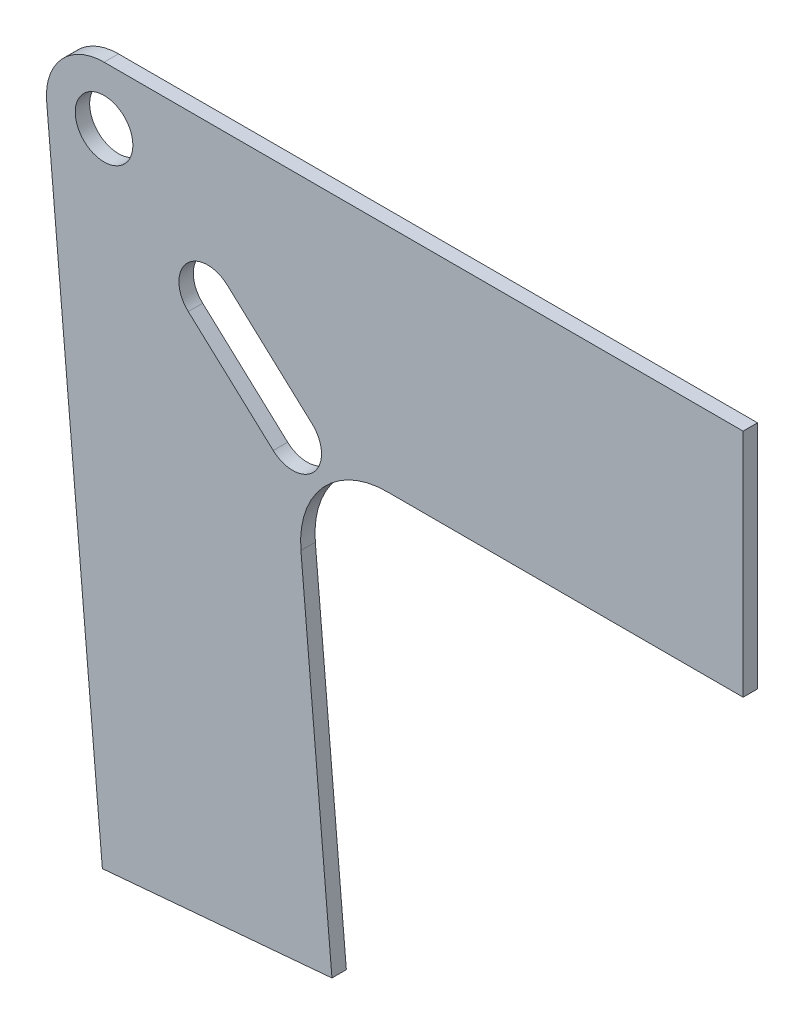
ISO-10303-21;
HEADER;
FILE_DESCRIPTION(('STEP AP214'),'2;1');
FILE_NAME('part.step','',(''),(''),'','','');
FILE_SCHEMA(('AUTOMOTIVE_DESIGN { 1 0 10303 214 1 1 1 1 }'));
ENDSEC;
DATA;
#1=APPLICATION_CONTEXT('core data for automotive mechanical design processes');
#2=APPLICATION_PROTOCOL_DEFINITION('international standard','automotive_design',2000,#1);
#3=PRODUCT_CONTEXT('',#1,'mechanical');
#4=PRODUCT('Part','Part','',(#3));
#5=PRODUCT_RELATED_PRODUCT_CATEGORY('part','',(#4));
#6=PRODUCT_DEFINITION_FORMATION('','',#4);
#7=PRODUCT_DEFINITION_CONTEXT('part definition',#1,'design');
#8=PRODUCT_DEFINITION('design','',#6,#7);
#9=PRODUCT_DEFINITION_SHAPE('','',#8);
#10=(LENGTH_UNIT() NAMED_UNIT(*) SI_UNIT(.MILLI.,.METRE.));
#11=(NAMED_UNIT(*) PLANE_ANGLE_UNIT() SI_UNIT($,.RADIAN.));
#12=(NAMED_UNIT(*) SI_UNIT($,.STERADIAN.) SOLID_ANGLE_UNIT());
#13=UNCERTAINTY_MEASURE_WITH_UNIT(LENGTH_MEASURE(1.E-05),#10,'distance_accuracy_value','');
#14=(GEOMETRIC_REPRESENTATION_CONTEXT(3) GLOBAL_UNCERTAINTY_ASSIGNED_CONTEXT((#13)) GLOBAL_UNIT_ASSIGNED_CONTEXT((#10,
#11,#12)) REPRESENTATION_CONTEXT('',''));
#15=CARTESIAN_POINT('',(0.,0.,0.));
#16=DIRECTION('',(0.,0.,1.));
#17=DIRECTION('',(1.,0.,0.));
#18=AXIS2_PLACEMENT_3D('',#15,#16,#17);
#19=CARTESIAN_POINT('',(-78.4913371274712,-44.45,3.175));
#20=DIRECTION('',(0.,0.,-1.));
#21=DIRECTION('',(-1.,0.,0.));
#22=AXIS2_PLACEMENT_3D('',#19,#20,#21);
#23=PLANE('',#22);
#24=DIRECTION('',(1.,0.,0.));
#25=VECTOR('',#24,1.);
#26=CARTESIAN_POINT('',(0.,-25.4,3.175));
#27=LINE('',#26,#25);
#28=CARTESIAN_POINT('',(-78.4913371274712,-25.4,3.175));
#29=VERTEX_POINT('',#28);
#30=CARTESIAN_POINT('',(0.,-25.4,3.175));
#31=VERTEX_POINT('',#30);
#32=EDGE_CURVE('E161',#29,#31,#27,.T.);
#33=ORIENTED_EDGE('',*,*,#32,.T.);
#34=DIRECTION('',(0.,1.,0.));
#35=VECTOR('',#34,1.);
#36=CARTESIAN_POINT('',(0.,25.4,3.175));
#37=LINE('',#36,#35);
#38=CARTESIAN_POINT('',(0.,25.4,3.175));
#39=VERTEX_POINT('',#38);
#40=EDGE_CURVE('E164',#31,#39,#37,.T.);
#41=ORIENTED_EDGE('',*,*,#40,.T.);
#42=DIRECTION('',(-1.,0.,0.));
#43=VECTOR('',#42,1.);
#44=CARTESIAN_POINT('',(-140.85961796358,25.4,3.175));
#45=LINE('',#44,#43);
#46=CARTESIAN_POINT('',(-140.85961796358,25.4,3.175));
#47=VERTEX_POINT('',#46);
#48=EDGE_CURVE('E167',#39,#47,#45,.T.);
#49=ORIENTED_EDGE('',*,*,#48,.T.);
#50=CARTESIAN_POINT('',(-140.85961796358,12.7,3.175));
#51=DIRECTION('',(0.,0.,1.));
#52=DIRECTION('',(-1.,0.,0.));
#53=AXIS2_PLACEMENT_3D('',#50,#51,#52);
#54=CIRCLE('',#53,12.7);
#55=CARTESIAN_POINT('',(-153.511290629345,11.5931220671048,3.175));
#56=VERTEX_POINT('',#55);
#57=EDGE_CURVE('E169',#47,#56,#54,.T.);
#58=ORIENTED_EDGE('',*,*,#57,.T.);
#59=DIRECTION('',(0.0871557427476542,-0.996194698091746,0.));
#60=VECTOR('',#59,1.);
#61=CARTESIAN_POINT('',(-141.234566002578,-128.730482523442,3.175));
#62=LINE('',#61,#60);
#63=CARTESIAN_POINT('',(-141.234566002578,-128.730482523442,3.175));
#64=VERTEX_POINT('',#63);
#65=EDGE_CURVE('E171',#56,#64,#62,.T.);
#66=ORIENTED_EDGE('',*,*,#65,.T.);
#67=DIRECTION('',(0.996194698091746,0.0871557427476551,0.));
#68=VECTOR('',#67,1.);
#69=CARTESIAN_POINT('',(-141.234566002578,-128.730482523442,3.175));
#70=LINE('',#69,#68);
#71=CARTESIAN_POINT('',(-90.6278753395175,-124.302970791861,3.175));
#72=VERTEX_POINT('',#71);
#73=EDGE_CURVE('E173',#64,#72,#70,.T.);
#74=ORIENTED_EDGE('',*,*,#73,.T.);
#75=DIRECTION('',(-0.0871557427476564,0.996194698091746,0.));
#76=VECTOR('',#75,1.);
#77=CARTESIAN_POINT('',(-90.6278753395175,-124.302970791861,3.175));
#78=LINE('',#77,#76);
#79=CARTESIAN_POINT('',(-97.4688461261189,-46.1103168993429,3.175));
#80=VERTEX_POINT('',#79);
#81=EDGE_CURVE('E175',#72,#80,#78,.T.);
#82=ORIENTED_EDGE('',*,*,#81,.T.);
#83=CARTESIAN_POINT('',(-78.4913371274712,-44.45,3.175));
#84=DIRECTION('',(0.,0.,-1.));
#85=DIRECTION('',(-1.,0.,0.));
#86=AXIS2_PLACEMENT_3D('',#83,#84,#85);
#87=CIRCLE('',#86,19.05);
#88=EDGE_CURVE('E177',#80,#29,#87,.T.);
#89=ORIENTED_EDGE('',*,*,#88,.T.);
#90=EDGE_LOOP('',(#33,#41,#49,#58,#66,#74,#82,#89));
#91=FACE_BOUND('',#90,.T.);
#92=CARTESIAN_POINT('',(-99.2807640728408,-25.4,3.175));
#93=DIRECTION('',(0.,0.,1.));
#94=DIRECTION('',(1.,0.,0.));
#95=AXIS2_PLACEMENT_3D('',#92,#93,#94);
#96=CIRCLE('',#95,6.35000000000001);
#97=CARTESIAN_POINT('',(-103.5707618912,-30.0817110887443,3.175));
#98=VERTEX_POINT('',#97);
#99=CARTESIAN_POINT('',(-94.9907662544813,-20.7182889112557,3.175));
#100=VERTEX_POINT('',#99);
#101=EDGE_CURVE('E122',#98,#100,#96,.T.);
#102=ORIENTED_EDGE('',*,*,#101,.F.);
#103=DIRECTION('',(0.737277336810121,-0.675590207615664,0.));
#104=VECTOR('',#103,1.);
#105=CARTESIAN_POINT('',(-103.5707618912,-30.0817110887443,3.175));
#106=LINE('',#105,#104);
#107=CARTESIAN_POINT('',(-122.297606246177,-12.9217198153064,3.175));
#108=VERTEX_POINT('',#107);
#109=EDGE_CURVE('E145',#108,#98,#106,.T.);
#110=ORIENTED_EDGE('',*,*,#109,.F.);
#111=CARTESIAN_POINT('',(-118.007608427818,-8.24000872656215,3.175));
#112=DIRECTION('',(0.,0.,1.));
#113=DIRECTION('',(1.,0.,0.));
#114=AXIS2_PLACEMENT_3D('',#111,#112,#113);
#115=CIRCLE('',#114,6.35);
#116=CARTESIAN_POINT('',(-113.717610609458,-3.55829763781789,3.175));
#117=VERTEX_POINT('',#116);
#118=EDGE_CURVE('E143',#117,#108,#115,.T.);
#119=ORIENTED_EDGE('',*,*,#118,.F.);
#120=DIRECTION('',(-0.737277336810121,0.675590207615663,0.));
#121=VECTOR('',#120,1.);
#122=CARTESIAN_POINT('',(-94.9907662544813,-20.7182889112557,3.175));
#123=LINE('',#122,#121);
#124=EDGE_CURVE('E130',#100,#117,#123,.T.);
#125=ORIENTED_EDGE('',*,*,#124,.F.);
#126=EDGE_LOOP('',(#102,#110,#119,#125));
#127=FACE_BOUND('',#126,.T.);
#128=CARTESIAN_POINT('',(-140.85961796358,12.7,3.175));
#129=DIRECTION('',(0.,0.,1.));
#130=DIRECTION('',(1.,0.,0.));
#131=AXIS2_PLACEMENT_3D('',#128,#129,#130);
#132=CIRCLE('',#131,6.35);
#133=CARTESIAN_POINT('',(-134.50961796358,12.7,3.175));
#134=VERTEX_POINT('',#133);
#135=EDGE_CURVE('E151',#134,#134,#132,.T.);
#136=ORIENTED_EDGE('',*,*,#135,.F.);
#137=EDGE_LOOP('',(#136));
#138=FACE_BOUND('',#137,.T.);
#139=ADVANCED_FACE('F33',(#91,#127,#138),#23,.F.);
#140=CARTESIAN_POINT('',(-78.4913371274712,-44.45,0.));
#141=DIRECTION('',(0.,0.,-1.));
#142=DIRECTION('',(-1.,0.,0.));
#143=AXIS2_PLACEMENT_3D('',#140,#141,#142);
#144=PLANE('',#143);
#145=DIRECTION('',(0.737277336810121,-0.675590207615664,0.));
#146=VECTOR('',#145,1.);
#147=CARTESIAN_POINT('',(-103.5707618912,-30.0817110887443,0.));
#148=LINE('',#147,#146);
#149=CARTESIAN_POINT('',(-122.297606246177,-12.9217198153064,0.));
#150=VERTEX_POINT('',#149);
#151=CARTESIAN_POINT('',(-103.5707618912,-30.0817110887443,0.));
#152=VERTEX_POINT('',#151);
#153=EDGE_CURVE('E131',#150,#152,#148,.T.);
#154=ORIENTED_EDGE('',*,*,#153,.T.);
#155=CARTESIAN_POINT('',(-99.2807640728408,-25.4,0.));
#156=DIRECTION('',(0.,0.,1.));
#157=DIRECTION('',(1.,0.,0.));
#158=AXIS2_PLACEMENT_3D('',#155,#156,#157);
#159=CIRCLE('',#158,6.35000000000001);
#160=CARTESIAN_POINT('',(-94.9907662544813,-20.7182889112557,0.));
#161=VERTEX_POINT('',#160);
#162=EDGE_CURVE('E56',#152,#161,#159,.T.);
#163=ORIENTED_EDGE('',*,*,#162,.T.);
#164=DIRECTION('',(-0.737277336810121,0.675590207615663,0.));
#165=VECTOR('',#164,1.);
#166=CARTESIAN_POINT('',(-94.9907662544813,-20.7182889112557,0.));
#167=LINE('',#166,#165);
#168=CARTESIAN_POINT('',(-113.717610609458,-3.55829763781789,0.));
#169=VERTEX_POINT('',#168);
#170=EDGE_CURVE('E137',#161,#169,#167,.T.);
#171=ORIENTED_EDGE('',*,*,#170,.T.);
#172=CARTESIAN_POINT('',(-118.007608427818,-8.24000872656215,0.));
#173=DIRECTION('',(0.,0.,1.));
#174=DIRECTION('',(1.,0.,0.));
#175=AXIS2_PLACEMENT_3D('',#172,#173,#174);
#176=CIRCLE('',#175,6.35);
#177=EDGE_CURVE('E153',#169,#150,#176,.T.);
#178=ORIENTED_EDGE('',*,*,#177,.T.);
#179=EDGE_LOOP('',(#154,#163,#171,#178));
#180=FACE_BOUND('',#179,.T.);
#181=DIRECTION('',(1.,0.,0.));
#182=VECTOR('',#181,1.);
#183=CARTESIAN_POINT('',(0.,-25.4,0.));
#184=LINE('',#183,#182);
#185=CARTESIAN_POINT('',(-78.4913371274712,-25.4,0.));
#186=VERTEX_POINT('',#185);
#187=CARTESIAN_POINT('',(0.,-25.4,0.));
#188=VERTEX_POINT('',#187);
#189=EDGE_CURVE('E138',#186,#188,#184,.T.);
#190=ORIENTED_EDGE('',*,*,#189,.F.);
#191=CARTESIAN_POINT('',(-78.4913371274712,-44.45,0.));
#192=DIRECTION('',(0.,0.,-1.));
#193=DIRECTION('',(-1.,0.,0.));
#194=AXIS2_PLACEMENT_3D('',#191,#192,#193);
#195=CIRCLE('',#194,19.05);
#196=CARTESIAN_POINT('',(-97.4688461261189,-46.1103168993429,0.));
#197=VERTEX_POINT('',#196);
#198=EDGE_CURVE('E165',#197,#186,#195,.T.);
#199=ORIENTED_EDGE('',*,*,#198,.F.);
#200=DIRECTION('',(-0.0871557427476564,0.996194698091746,0.));
#201=VECTOR('',#200,1.);
#202=CARTESIAN_POINT('',(-90.6278753395175,-124.302970791861,0.));
#203=LINE('',#202,#201);
#204=CARTESIAN_POINT('',(-90.6278753395175,-124.302970791861,0.));
#205=VERTEX_POINT('',#204);
#206=EDGE_CURVE('E192',#205,#197,#203,.T.);
#207=ORIENTED_EDGE('',*,*,#206,.F.);
#208=DIRECTION('',(0.996194698091746,0.0871557427476551,0.));
#209=VECTOR('',#208,1.);
#210=CARTESIAN_POINT('',(-141.234566002578,-128.730482523442,0.));
#211=LINE('',#210,#209);
#212=CARTESIAN_POINT('',(-141.234566002578,-128.730482523442,0.));
#213=VERTEX_POINT('',#212);
#214=EDGE_CURVE('E190',#213,#205,#211,.T.);
#215=ORIENTED_EDGE('',*,*,#214,.F.);
#216=DIRECTION('',(0.0871557427476542,-0.996194698091746,0.));
#217=VECTOR('',#216,1.);
#218=CARTESIAN_POINT('',(-141.234566002578,-128.730482523442,0.));
#219=LINE('',#218,#217);
#220=CARTESIAN_POINT('',(-153.511290629345,11.5931220671048,0.));
#221=VERTEX_POINT('',#220);
#222=EDGE_CURVE('E188',#221,#213,#219,.T.);
#223=ORIENTED_EDGE('',*,*,#222,.F.);
#224=CARTESIAN_POINT('',(-140.85961796358,12.7,0.));
#225=DIRECTION('',(0.,0.,1.));
#226=DIRECTION('',(-1.,0.,0.));
#227=AXIS2_PLACEMENT_3D('',#224,#225,#226);
#228=CIRCLE('',#227,12.7);
#229=CARTESIAN_POINT('',(-140.85961796358,25.4,0.));
#230=VERTEX_POINT('',#229);
#231=EDGE_CURVE('E186',#230,#221,#228,.T.);
#232=ORIENTED_EDGE('',*,*,#231,.F.);
#233=DIRECTION('',(-1.,0.,0.));
#234=VECTOR('',#233,1.);
#235=CARTESIAN_POINT('',(-140.85961796358,25.4,0.));
#236=LINE('',#235,#234);
#237=CARTESIAN_POINT('',(0.,25.4,0.));
#238=VERTEX_POINT('',#237);
#239=EDGE_CURVE('E184',#238,#230,#236,.T.);
#240=ORIENTED_EDGE('',*,*,#239,.F.);
#241=DIRECTION('',(0.,1.,0.));
#242=VECTOR('',#241,1.);
#243=CARTESIAN_POINT('',(0.,25.4,0.));
#244=LINE('',#243,#242);
#245=EDGE_CURVE('E182',#188,#238,#244,.T.);
#246=ORIENTED_EDGE('',*,*,#245,.F.);
#247=EDGE_LOOP('',(#190,#199,#207,#215,#223,#232,#240,#246));
#248=FACE_BOUND('',#247,.T.);
#249=CARTESIAN_POINT('',(-140.85961796358,12.7,0.));
#250=DIRECTION('',(0.,0.,1.));
#251=DIRECTION('',(1.,0.,0.));
#252=AXIS2_PLACEMENT_3D('',#249,#250,#251);
#253=CIRCLE('',#252,6.35);
#254=CARTESIAN_POINT('',(-134.50961796358,12.7,0.));
#255=VERTEX_POINT('',#254);
#256=EDGE_CURVE('E298',#255,#255,#253,.T.);
#257=ORIENTED_EDGE('',*,*,#256,.T.);
#258=EDGE_LOOP('',(#257));
#259=FACE_BOUND('',#258,.T.);
#260=ADVANCED_FACE('F222',(#180,#248,#259),#144,.T.);
#261=CARTESIAN_POINT('',(0.,-25.4,3.175));
#262=DIRECTION('',(0.,1.,0.));
#263=DIRECTION('',(0.,0.,1.));
#264=AXIS2_PLACEMENT_3D('',#261,#262,#263);
#265=PLANE('',#264);
#266=ORIENTED_EDGE('',*,*,#189,.T.);
#267=DIRECTION('',(0.,0.,-1.));
#268=VECTOR('',#267,1.);
#269=CARTESIAN_POINT('',(0.,-25.4,3.175));
#270=LINE('',#269,#268);
#271=EDGE_CURVE('E11',#31,#188,#270,.T.);
#272=ORIENTED_EDGE('',*,*,#271,.F.);
#273=ORIENTED_EDGE('',*,*,#32,.F.);
#274=DIRECTION('',(0.,0.,-1.));
#275=VECTOR('',#274,1.);
#276=CARTESIAN_POINT('',(-78.4913371274712,-25.4,3.175));
#277=LINE('',#276,#275);
#278=EDGE_CURVE('E179',#29,#186,#277,.T.);
#279=ORIENTED_EDGE('',*,*,#278,.T.);
#280=EDGE_LOOP('',(#266,#272,#273,#279));
#281=FACE_BOUND('',#280,.T.);
#282=ADVANCED_FACE('F35',(#281),#265,.F.);
#283=CARTESIAN_POINT('',(0.,25.4,3.175));
#284=DIRECTION('',(-1.,0.,0.));
#285=DIRECTION('',(0.,-1.,0.));
#286=AXIS2_PLACEMENT_3D('',#283,#284,#285);
#287=PLANE('',#286);
#288=ORIENTED_EDGE('',*,*,#245,.T.);
#289=DIRECTION('',(0.,0.,-1.));
#290=VECTOR('',#289,1.);
#291=CARTESIAN_POINT('',(0.,25.4,3.175));
#292=LINE('',#291,#290);
#293=EDGE_CURVE('E41',#39,#238,#292,.T.);
#294=ORIENTED_EDGE('',*,*,#293,.F.);
#295=ORIENTED_EDGE('',*,*,#40,.F.);
#296=ORIENTED_EDGE('',*,*,#271,.T.);
#297=EDGE_LOOP('',(#288,#294,#295,#296));
#298=FACE_BOUND('',#297,.T.);
#299=ADVANCED_FACE('F239',(#298),#287,.F.);
#300=CARTESIAN_POINT('',(-140.85961796358,25.4,3.175));
#301=DIRECTION('',(0.,-1.,0.));
#302=DIRECTION('',(1.,0.,0.));
#303=AXIS2_PLACEMENT_3D('',#300,#301,#302);
#304=PLANE('',#303);
#305=ORIENTED_EDGE('',*,*,#239,.T.);
#306=DIRECTION('',(0.,0.,-1.));
#307=VECTOR('',#306,1.);
#308=CARTESIAN_POINT('',(-140.85961796358,25.4,3.175));
#309=LINE('',#308,#307);
#310=EDGE_CURVE('E209',#47,#230,#309,.T.);
#311=ORIENTED_EDGE('',*,*,#310,.F.);
#312=ORIENTED_EDGE('',*,*,#48,.F.);
#313=ORIENTED_EDGE('',*,*,#293,.T.);
#314=EDGE_LOOP('',(#305,#311,#312,#313));
#315=FACE_BOUND('',#314,.T.);
#316=ADVANCED_FACE('F216',(#315),#304,.F.);
#317=CARTESIAN_POINT('',(-140.85961796358,12.7,3.175));
#318=DIRECTION('',(0.,0.,-1.));
#319=DIRECTION('',(-1.,0.,0.));
#320=AXIS2_PLACEMENT_3D('',#317,#318,#319);
#321=CYLINDRICAL_SURFACE('',#320,12.7);
#322=ORIENTED_EDGE('',*,*,#231,.T.);
#323=DIRECTION('',(0.,0.,-1.));
#324=VECTOR('',#323,1.);
#325=CARTESIAN_POINT('',(-153.511290629345,11.5931220671048,3.175));
#326=LINE('',#325,#324);
#327=EDGE_CURVE('E206',#56,#221,#326,.T.);
#328=ORIENTED_EDGE('',*,*,#327,.F.);
#329=ORIENTED_EDGE('',*,*,#57,.F.);
#330=ORIENTED_EDGE('',*,*,#310,.T.);
#331=EDGE_LOOP('',(#322,#328,#329,#330));
#332=FACE_BOUND('',#331,.T.);
#333=ADVANCED_FACE('F228',(#332),#321,.T.);
#334=CARTESIAN_POINT('',(-141.234566002578,-128.730482523442,3.175));
#335=DIRECTION('',(0.996194698091746,0.0871557427476542,0.));
#336=DIRECTION('',(-0.0871557427476542,0.996194698091746,0.));
#337=AXIS2_PLACEMENT_3D('',#334,#335,#336);
#338=PLANE('',#337);
#339=ORIENTED_EDGE('',*,*,#222,.T.);
#340=DIRECTION('',(0.,0.,-1.));
#341=VECTOR('',#340,1.);
#342=CARTESIAN_POINT('',(-141.234566002578,-128.730482523442,3.175));
#343=LINE('',#342,#341);
#344=EDGE_CURVE('E203',#64,#213,#343,.T.);
#345=ORIENTED_EDGE('',*,*,#344,.F.);
#346=ORIENTED_EDGE('',*,*,#65,.F.);
#347=ORIENTED_EDGE('',*,*,#327,.T.);
#348=EDGE_LOOP('',(#339,#345,#346,#347));
#349=FACE_BOUND('',#348,.T.);
#350=ADVANCED_FACE('F232',(#349),#338,.F.);
#351=CARTESIAN_POINT('',(-141.234566002578,-128.730482523442,3.175));
#352=DIRECTION('',(-0.0871557427476551,0.996194698091746,0.));
#353=DIRECTION('',(-0.996194698091746,-0.0871557427476551,0.));
#354=AXIS2_PLACEMENT_3D('',#351,#352,#353);
#355=PLANE('',#354);
#356=ORIENTED_EDGE('',*,*,#214,.T.);
#357=DIRECTION('',(0.,0.,-1.));
#358=VECTOR('',#357,1.);
#359=CARTESIAN_POINT('',(-90.6278753395175,-124.302970791861,3.175));
#360=LINE('',#359,#358);
#361=EDGE_CURVE('E200',#72,#205,#360,.T.);
#362=ORIENTED_EDGE('',*,*,#361,.F.);
#363=ORIENTED_EDGE('',*,*,#73,.F.);
#364=ORIENTED_EDGE('',*,*,#344,.T.);
#365=EDGE_LOOP('',(#356,#362,#363,#364));
#366=FACE_BOUND('',#365,.T.);
#367=ADVANCED_FACE('F252',(#366),#355,.F.);
#368=CARTESIAN_POINT('',(-90.6278753395175,-124.302970791861,3.175));
#369=DIRECTION('',(-0.996194698091746,-0.0871557427476564,0.));
#370=DIRECTION('',(0.0871557427476564,-0.996194698091746,0.));
#371=AXIS2_PLACEMENT_3D('',#368,#369,#370);
#372=PLANE('',#371);
#373=ORIENTED_EDGE('',*,*,#206,.T.);
#374=DIRECTION('',(0.,0.,-1.));
#375=VECTOR('',#374,1.);
#376=CARTESIAN_POINT('',(-97.4688461261189,-46.1103168993429,3.175));
#377=LINE('',#376,#375);
#378=EDGE_CURVE('E197',#80,#197,#377,.T.);
#379=ORIENTED_EDGE('',*,*,#378,.F.);
#380=ORIENTED_EDGE('',*,*,#81,.F.);
#381=ORIENTED_EDGE('',*,*,#361,.T.);
#382=EDGE_LOOP('',(#373,#379,#380,#381));
#383=FACE_BOUND('',#382,.T.);
#384=ADVANCED_FACE('F250',(#383),#372,.F.);
#385=CARTESIAN_POINT('',(-78.4913371274712,-44.45,3.175));
#386=DIRECTION('',(0.,0.,-1.));
#387=DIRECTION('',(-1.,0.,0.));
#388=AXIS2_PLACEMENT_3D('',#385,#386,#387);
#389=CYLINDRICAL_SURFACE('',#388,19.05);
#390=ORIENTED_EDGE('',*,*,#198,.T.);
#391=ORIENTED_EDGE('',*,*,#278,.F.);
#392=ORIENTED_EDGE('',*,*,#88,.F.);
#393=ORIENTED_EDGE('',*,*,#378,.T.);
#394=EDGE_LOOP('',(#390,#391,#392,#393));
#395=FACE_BOUND('',#394,.T.);
#396=ADVANCED_FACE('F245',(#395),#389,.F.);
#397=CARTESIAN_POINT('',(-99.2807640728408,-25.4,3.175));
#398=DIRECTION('',(0.,0.,-1.));
#399=DIRECTION('',(-1.,0.,0.));
#400=AXIS2_PLACEMENT_3D('',#397,#398,#399);
#401=CYLINDRICAL_SURFACE('',#400,6.35000000000001);
#402=ORIENTED_EDGE('',*,*,#162,.F.);
#403=DIRECTION('',(0.,0.,-1.));
#404=VECTOR('',#403,1.);
#405=CARTESIAN_POINT('',(-103.5707618912,-30.0817110887443,3.175));
#406=LINE('',#405,#404);
#407=EDGE_CURVE('E126',#98,#152,#406,.T.);
#408=ORIENTED_EDGE('',*,*,#407,.F.);
#409=ORIENTED_EDGE('',*,*,#101,.T.);
#410=DIRECTION('',(0.,0.,-1.));
#411=VECTOR('',#410,1.);
#412=CARTESIAN_POINT('',(-94.9907662544813,-20.7182889112557,3.175));
#413=LINE('',#412,#411);
#414=EDGE_CURVE('E125',#100,#161,#413,.T.);
#415=ORIENTED_EDGE('',*,*,#414,.T.);
#416=EDGE_LOOP('',(#402,#408,#409,#415));
#417=FACE_BOUND('',#416,.T.);
#418=ADVANCED_FACE('F124',(#417),#401,.F.);
#419=CARTESIAN_POINT('',(-94.9907662544813,-20.7182889112557,3.175));
#420=DIRECTION('',(-0.675590207615663,-0.737277336810121,0.));
#421=DIRECTION('',(0.737277336810121,-0.675590207615663,0.));
#422=AXIS2_PLACEMENT_3D('',#419,#420,#421);
#423=PLANE('',#422);
#424=ORIENTED_EDGE('',*,*,#170,.F.);
#425=ORIENTED_EDGE('',*,*,#414,.F.);
#426=ORIENTED_EDGE('',*,*,#124,.T.);
#427=DIRECTION('',(0.,0.,-1.));
#428=VECTOR('',#427,1.);
#429=CARTESIAN_POINT('',(-113.717610609458,-3.55829763781789,3.175));
#430=LINE('',#429,#428);
#431=EDGE_CURVE('E139',#117,#169,#430,.T.);
#432=ORIENTED_EDGE('',*,*,#431,.T.);
#433=EDGE_LOOP('',(#424,#425,#426,#432));
#434=FACE_BOUND('',#433,.T.);
#435=ADVANCED_FACE('F134',(#434),#423,.T.);
#436=CARTESIAN_POINT('',(-118.007608427818,-8.24000872656215,3.175));
#437=DIRECTION('',(0.,0.,-1.));
#438=DIRECTION('',(-1.,0.,0.));
#439=AXIS2_PLACEMENT_3D('',#436,#437,#438);
#440=CYLINDRICAL_SURFACE('',#439,6.35);
#441=ORIENTED_EDGE('',*,*,#177,.F.);
#442=ORIENTED_EDGE('',*,*,#431,.F.);
#443=ORIENTED_EDGE('',*,*,#118,.T.);
#444=DIRECTION('',(0.,0.,-1.));
#445=VECTOR('',#444,1.);
#446=CARTESIAN_POINT('',(-122.297606246177,-12.9217198153064,3.175));
#447=LINE('',#446,#445);
#448=EDGE_CURVE('E48',#108,#150,#447,.T.);
#449=ORIENTED_EDGE('',*,*,#448,.T.);
#450=EDGE_LOOP('',(#441,#442,#443,#449));
#451=FACE_BOUND('',#450,.T.);
#452=ADVANCED_FACE('F278',(#451),#440,.F.);
#453=CARTESIAN_POINT('',(-103.5707618912,-30.0817110887443,3.175));
#454=DIRECTION('',(0.675590207615664,0.737277336810121,0.));
#455=DIRECTION('',(-0.737277336810121,0.675590207615664,0.));
#456=AXIS2_PLACEMENT_3D('',#453,#454,#455);
#457=PLANE('',#456);
#458=ORIENTED_EDGE('',*,*,#153,.F.);
#459=ORIENTED_EDGE('',*,*,#448,.F.);
#460=ORIENTED_EDGE('',*,*,#109,.T.);
#461=ORIENTED_EDGE('',*,*,#407,.T.);
#462=EDGE_LOOP('',(#458,#459,#460,#461));
#463=FACE_BOUND('',#462,.T.);
#464=ADVANCED_FACE('F282',(#463),#457,.T.);
#465=CARTESIAN_POINT('',(-140.85961796358,12.7,3.175));
#466=DIRECTION('',(0.,0.,-1.));
#467=DIRECTION('',(-1.,0.,0.));
#468=AXIS2_PLACEMENT_3D('',#465,#466,#467);
#469=CYLINDRICAL_SURFACE('',#468,6.35);
#470=ORIENTED_EDGE('',*,*,#135,.T.);
#471=EDGE_LOOP('',(#470));
#472=FACE_BOUND('',#471,.T.);
#473=ORIENTED_EDGE('',*,*,#256,.F.);
#474=EDGE_LOOP('',(#473));
#475=FACE_BOUND('',#474,.T.);
#476=ADVANCED_FACE('F288',(#472,#475),#469,.F.);
#477=CLOSED_SHELL('',(#139,#260,#282,#299,#316,#333,#350,#367,#384,#396,#418,#435,#452,#464,#476));
#478=MANIFOLD_SOLID_BREP('B2',#477);
#479=ADVANCED_BREP_SHAPE_REPRESENTATION('',(#18,#478),#14);
#480=SHAPE_DEFINITION_REPRESENTATION(#9,#479);
ENDSEC;
END-ISO-10303-21;
